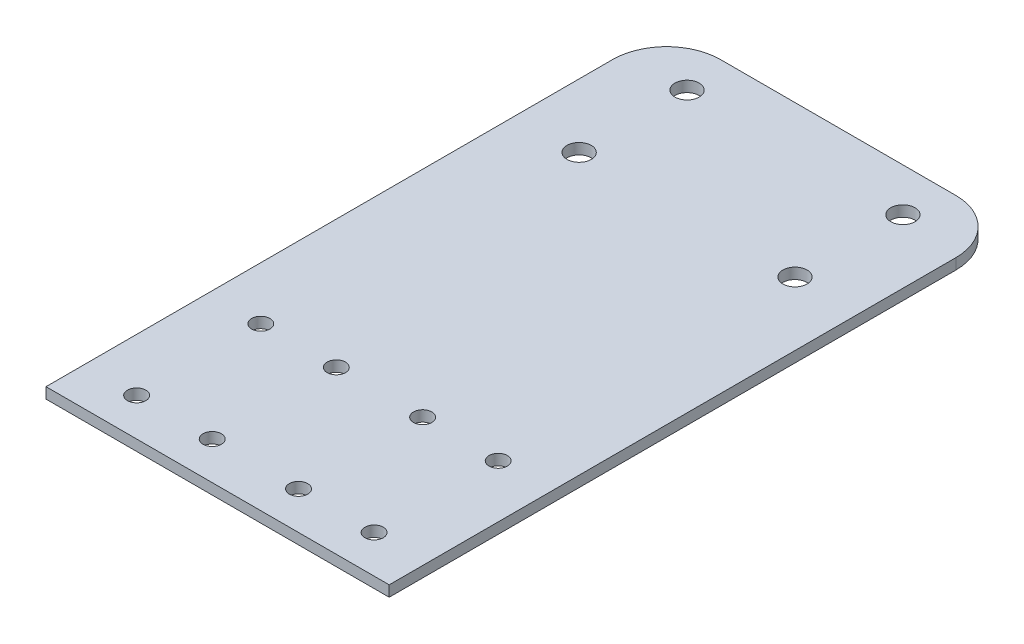
ISO-10303-21;
HEADER;
FILE_DESCRIPTION(('STEP AP214'),'2;1');
FILE_NAME('part.step','',(''),(''),'','','');
FILE_SCHEMA(('AUTOMOTIVE_DESIGN { 1 0 10303 214 1 1 1 1 }'));
ENDSEC;
DATA;
#1=APPLICATION_CONTEXT('core data for automotive mechanical design processes');
#2=APPLICATION_PROTOCOL_DEFINITION('international standard','automotive_design',2000,#1);
#3=PRODUCT_CONTEXT('',#1,'mechanical');
#4=PRODUCT('Part','Part','',(#3));
#5=PRODUCT_RELATED_PRODUCT_CATEGORY('part','',(#4));
#6=PRODUCT_DEFINITION_FORMATION('','',#4);
#7=PRODUCT_DEFINITION_CONTEXT('part definition',#1,'design');
#8=PRODUCT_DEFINITION('design','',#6,#7);
#9=PRODUCT_DEFINITION_SHAPE('','',#8);
#10=(LENGTH_UNIT() NAMED_UNIT(*) SI_UNIT(.MILLI.,.METRE.));
#11=(NAMED_UNIT(*) PLANE_ANGLE_UNIT() SI_UNIT($,.RADIAN.));
#12=(NAMED_UNIT(*) SI_UNIT($,.STERADIAN.) SOLID_ANGLE_UNIT());
#13=UNCERTAINTY_MEASURE_WITH_UNIT(LENGTH_MEASURE(1.E-05),#10,'distance_accuracy_value','');
#14=(GEOMETRIC_REPRESENTATION_CONTEXT(3) GLOBAL_UNCERTAINTY_ASSIGNED_CONTEXT((#13)) GLOBAL_UNIT_ASSIGNED_CONTEXT((#10,
#11,#12)) REPRESENTATION_CONTEXT('',''));
#15=CARTESIAN_POINT('',(0.,0.,0.));
#16=DIRECTION('',(0.,0.,1.));
#17=DIRECTION('',(1.,0.,0.));
#18=AXIS2_PLACEMENT_3D('',#15,#16,#17);
#19=CARTESIAN_POINT('',(31.8,0.,0.));
#20=DIRECTION('',(0.,0.,1.));
#21=DIRECTION('',(1.,0.,0.));
#22=AXIS2_PLACEMENT_3D('',#19,#20,#21);
#23=PLANE('',#22);
#24=DIRECTION('',(-1.,0.,0.));
#25=VECTOR('',#24,1.);
#26=CARTESIAN_POINT('',(31.8,0.,0.));
#27=LINE('',#26,#25);
#28=CARTESIAN_POINT('',(21.8,0.,0.));
#29=VERTEX_POINT('',#28);
#30=CARTESIAN_POINT('',(-21.8,0.,0.));
#31=VERTEX_POINT('',#30);
#32=EDGE_CURVE('E123',#29,#31,#27,.T.);
#33=ORIENTED_EDGE('',*,*,#32,.T.);
#34=DIRECTION('',(0.,1.,0.));
#35=VECTOR('',#34,1.);
#36=CARTESIAN_POINT('',(-21.8,0.,0.));
#37=LINE('',#36,#35);
#38=CARTESIAN_POINT('',(-21.8,2.,0.));
#39=VERTEX_POINT('',#38);
#40=EDGE_CURVE('E133',#31,#39,#37,.T.);
#41=ORIENTED_EDGE('',*,*,#40,.T.);
#42=DIRECTION('',(-1.,0.,0.));
#43=VECTOR('',#42,1.);
#44=CARTESIAN_POINT('',(31.8,2.,0.));
#45=LINE('',#44,#43);
#46=CARTESIAN_POINT('',(21.8,2.,0.));
#47=VERTEX_POINT('',#46);
#48=EDGE_CURVE('E107',#47,#39,#45,.T.);
#49=ORIENTED_EDGE('',*,*,#48,.F.);
#50=DIRECTION('',(0.,1.,0.));
#51=VECTOR('',#50,1.);
#52=CARTESIAN_POINT('',(21.8,0.,0.));
#53=LINE('',#52,#51);
#54=EDGE_CURVE('E126',#47,#29,#53,.F.);
#55=ORIENTED_EDGE('',*,*,#54,.T.);
#56=EDGE_LOOP('',(#33,#41,#49,#55));
#57=FACE_BOUND('',#56,.T.);
#58=ADVANCED_FACE('F34',(#57),#23,.F.);
#59=CARTESIAN_POINT('',(31.8,1.99999999999999,55.));
#60=DIRECTION('',(0.,-1.,0.));
#61=DIRECTION('',(0.,0.,-1.));
#62=AXIS2_PLACEMENT_3D('',#59,#60,#61);
#63=PLANE('',#62);
#64=CARTESIAN_POINT('',(-20.,2.,28.));
#65=DIRECTION('',(0.,1.,0.));
#66=DIRECTION('',(0.,0.,1.));
#67=AXIS2_PLACEMENT_3D('',#64,#65,#66);
#68=CIRCLE('',#67,2.25);
#69=CARTESIAN_POINT('',(-20.,2.,30.25));
#70=VERTEX_POINT('',#69);
#71=EDGE_CURVE('E214',#70,#70,#68,.T.);
#72=ORIENTED_EDGE('',*,*,#71,.F.);
#73=EDGE_LOOP('',(#72));
#74=FACE_BOUND('',#73,.T.);
#75=CARTESIAN_POINT('',(20.,2.,28.));
#76=DIRECTION('',(0.,1.,0.));
#77=DIRECTION('',(0.,0.,1.));
#78=AXIS2_PLACEMENT_3D('',#75,#76,#77);
#79=CIRCLE('',#78,2.25);
#80=CARTESIAN_POINT('',(20.,2.,30.25));
#81=VERTEX_POINT('',#80);
#82=EDGE_CURVE('E131',#81,#81,#79,.T.);
#83=ORIENTED_EDGE('',*,*,#82,.F.);
#84=EDGE_LOOP('',(#83));
#85=FACE_BOUND('',#84,.T.);
#86=CARTESIAN_POINT('',(20.,2.,8.));
#87=DIRECTION('',(0.,1.,0.));
#88=DIRECTION('',(0.,0.,1.));
#89=AXIS2_PLACEMENT_3D('',#86,#87,#88);
#90=CIRCLE('',#89,2.25);
#91=CARTESIAN_POINT('',(20.,2.,10.25));
#92=VERTEX_POINT('',#91);
#93=EDGE_CURVE('E130',#92,#92,#90,.T.);
#94=ORIENTED_EDGE('',*,*,#93,.F.);
#95=EDGE_LOOP('',(#94));
#96=FACE_BOUND('',#95,.T.);
#97=CARTESIAN_POINT('',(-20.,2.,8.));
#98=DIRECTION('',(0.,1.,0.));
#99=DIRECTION('',(0.,0.,1.));
#100=AXIS2_PLACEMENT_3D('',#97,#98,#99);
#101=CIRCLE('',#100,2.25);
#102=CARTESIAN_POINT('',(-20.,2.,10.25));
#103=VERTEX_POINT('',#102);
#104=EDGE_CURVE('E201',#103,#103,#101,.T.);
#105=ORIENTED_EDGE('',*,*,#104,.F.);
#106=EDGE_LOOP('',(#105));
#107=FACE_BOUND('',#106,.T.);
#108=CARTESIAN_POINT('',(-22.,1.99999999999999,108.));
#109=DIRECTION('',(0.,1.,0.));
#110=DIRECTION('',(0.,0.,1.));
#111=AXIS2_PLACEMENT_3D('',#108,#109,#110);
#112=CIRCLE('',#111,1.69999999999999);
#113=CARTESIAN_POINT('',(-22.,1.99999999999999,109.7));
#114=VERTEX_POINT('',#113);
#115=EDGE_CURVE('E195',#114,#114,#112,.T.);
#116=ORIENTED_EDGE('',*,*,#115,.F.);
#117=EDGE_LOOP('',(#116));
#118=FACE_BOUND('',#117,.T.);
#119=CARTESIAN_POINT('',(-22.,1.99999999999999,85.));
#120=DIRECTION('',(0.,1.,0.));
#121=DIRECTION('',(0.,0.,1.));
#122=AXIS2_PLACEMENT_3D('',#119,#120,#121);
#123=CIRCLE('',#122,1.69999999999999);
#124=CARTESIAN_POINT('',(-22.,1.99999999999999,86.7));
#125=VERTEX_POINT('',#124);
#126=EDGE_CURVE('E189',#125,#125,#123,.T.);
#127=ORIENTED_EDGE('',*,*,#126,.F.);
#128=EDGE_LOOP('',(#127));
#129=FACE_BOUND('',#128,.T.);
#130=CARTESIAN_POINT('',(-8.,1.99999999999999,85.));
#131=DIRECTION('',(0.,1.,0.));
#132=DIRECTION('',(0.,0.,1.));
#133=AXIS2_PLACEMENT_3D('',#130,#131,#132);
#134=CIRCLE('',#133,1.69999999999999);
#135=CARTESIAN_POINT('',(-8.,1.99999999999999,86.7));
#136=VERTEX_POINT('',#135);
#137=EDGE_CURVE('E183',#136,#136,#134,.T.);
#138=ORIENTED_EDGE('',*,*,#137,.F.);
#139=EDGE_LOOP('',(#138));
#140=FACE_BOUND('',#139,.T.);
#141=CARTESIAN_POINT('',(-8.,1.99999999999999,108.));
#142=DIRECTION('',(0.,1.,0.));
#143=DIRECTION('',(0.,0.,1.));
#144=AXIS2_PLACEMENT_3D('',#141,#142,#143);
#145=CIRCLE('',#144,1.69999999999999);
#146=CARTESIAN_POINT('',(-8.,1.99999999999999,109.7));
#147=VERTEX_POINT('',#146);
#148=EDGE_CURVE('E177',#147,#147,#145,.T.);
#149=ORIENTED_EDGE('',*,*,#148,.F.);
#150=EDGE_LOOP('',(#149));
#151=FACE_BOUND('',#150,.T.);
#152=CARTESIAN_POINT('',(22.,1.99999999999999,108.));
#153=DIRECTION('',(0.,1.,0.));
#154=DIRECTION('',(0.,0.,1.));
#155=AXIS2_PLACEMENT_3D('',#152,#153,#154);
#156=CIRCLE('',#155,1.69999999999999);
#157=CARTESIAN_POINT('',(22.,1.99999999999999,109.7));
#158=VERTEX_POINT('',#157);
#159=EDGE_CURVE('E171',#158,#158,#156,.T.);
#160=ORIENTED_EDGE('',*,*,#159,.F.);
#161=EDGE_LOOP('',(#160));
#162=FACE_BOUND('',#161,.T.);
#163=CARTESIAN_POINT('',(8.,1.99999999999999,108.));
#164=DIRECTION('',(0.,1.,0.));
#165=DIRECTION('',(0.,0.,1.));
#166=AXIS2_PLACEMENT_3D('',#163,#164,#165);
#167=CIRCLE('',#166,1.69999999999999);
#168=CARTESIAN_POINT('',(8.,1.99999999999999,109.7));
#169=VERTEX_POINT('',#168);
#170=EDGE_CURVE('E165',#169,#169,#167,.T.);
#171=ORIENTED_EDGE('',*,*,#170,.F.);
#172=EDGE_LOOP('',(#171));
#173=FACE_BOUND('',#172,.T.);
#174=CARTESIAN_POINT('',(8.,1.99999999999999,85.));
#175=DIRECTION('',(0.,1.,0.));
#176=DIRECTION('',(0.,0.,1.));
#177=AXIS2_PLACEMENT_3D('',#174,#175,#176);
#178=CIRCLE('',#177,1.69999999999999);
#179=CARTESIAN_POINT('',(8.,1.99999999999999,86.7));
#180=VERTEX_POINT('',#179);
#181=EDGE_CURVE('E159',#180,#180,#178,.T.);
#182=ORIENTED_EDGE('',*,*,#181,.F.);
#183=EDGE_LOOP('',(#182));
#184=FACE_BOUND('',#183,.T.);
#185=CARTESIAN_POINT('',(22.,1.99999999999999,85.));
#186=DIRECTION('',(0.,1.,0.));
#187=DIRECTION('',(0.,0.,1.));
#188=AXIS2_PLACEMENT_3D('',#185,#186,#187);
#189=CIRCLE('',#188,1.69999999999999);
#190=CARTESIAN_POINT('',(22.,1.99999999999999,86.7));
#191=VERTEX_POINT('',#190);
#192=EDGE_CURVE('E153',#191,#191,#189,.T.);
#193=ORIENTED_EDGE('',*,*,#192,.F.);
#194=EDGE_LOOP('',(#193));
#195=FACE_BOUND('',#194,.T.);
#196=ORIENTED_EDGE('',*,*,#48,.T.);
#197=CARTESIAN_POINT('',(-21.8,2.,10.));
#198=DIRECTION('',(0.,-1.,0.));
#199=DIRECTION('',(0.,0.,-1.));
#200=AXIS2_PLACEMENT_3D('',#197,#198,#199);
#201=CIRCLE('',#200,10.);
#202=CARTESIAN_POINT('',(-31.8,2.,10.));
#203=VERTEX_POINT('',#202);
#204=EDGE_CURVE('E138',#39,#203,#201,.F.);
#205=ORIENTED_EDGE('',*,*,#204,.T.);
#206=DIRECTION('',(0.,0.,1.));
#207=VECTOR('',#206,1.);
#208=CARTESIAN_POINT('',(-31.8,1.99999999999999,55.));
#209=LINE('',#208,#207);
#210=CARTESIAN_POINT('',(-31.8,1.99999999999999,115.));
#211=VERTEX_POINT('',#210);
#212=EDGE_CURVE('E103',#203,#211,#209,.T.);
#213=ORIENTED_EDGE('',*,*,#212,.T.);
#214=DIRECTION('',(-1.,0.,0.));
#215=VECTOR('',#214,1.);
#216=CARTESIAN_POINT('',(31.8,1.99999999999999,115.));
#217=LINE('',#216,#215);
#218=CARTESIAN_POINT('',(31.8,1.99999999999999,115.));
#219=VERTEX_POINT('',#218);
#220=EDGE_CURVE('E100',#219,#211,#217,.T.);
#221=ORIENTED_EDGE('',*,*,#220,.F.);
#222=DIRECTION('',(0.,0.,1.));
#223=VECTOR('',#222,1.);
#224=CARTESIAN_POINT('',(31.8,2.,0.));
#225=LINE('',#224,#223);
#226=CARTESIAN_POINT('',(31.8,2.,10.));
#227=VERTEX_POINT('',#226);
#228=EDGE_CURVE('E89',#227,#219,#225,.T.);
#229=ORIENTED_EDGE('',*,*,#228,.F.);
#230=CARTESIAN_POINT('',(21.8,2.,10.));
#231=DIRECTION('',(0.,-1.,0.));
#232=DIRECTION('',(0.,0.,-1.));
#233=AXIS2_PLACEMENT_3D('',#230,#231,#232);
#234=CIRCLE('',#233,10.);
#235=EDGE_CURVE('E136',#227,#47,#234,.F.);
#236=ORIENTED_EDGE('',*,*,#235,.T.);
#237=EDGE_LOOP('',(#196,#205,#213,#221,#229,#236));
#238=FACE_BOUND('',#237,.T.);
#239=ADVANCED_FACE('F102',(#74,#85,#96,#107,#118,#129,#140,#151,#162,#173,#184,#195,#238),#63,.F.);
#240=CARTESIAN_POINT('',(31.8,1.99999999999999,115.));
#241=DIRECTION('',(0.,0.,-1.));
#242=DIRECTION('',(-1.,0.,0.));
#243=AXIS2_PLACEMENT_3D('',#240,#241,#242);
#244=PLANE('',#243);
#245=DIRECTION('',(0.,-1.,0.));
#246=VECTOR('',#245,1.);
#247=CARTESIAN_POINT('',(-31.8,1.99999999999999,115.));
#248=LINE('',#247,#246);
#249=CARTESIAN_POINT('',(-31.8,0.,115.));
#250=VERTEX_POINT('',#249);
#251=EDGE_CURVE('E117',#211,#250,#248,.T.);
#252=ORIENTED_EDGE('',*,*,#251,.T.);
#253=DIRECTION('',(-1.,0.,0.));
#254=VECTOR('',#253,1.);
#255=CARTESIAN_POINT('',(31.8,0.,115.));
#256=LINE('',#255,#254);
#257=CARTESIAN_POINT('',(31.8,0.,115.));
#258=VERTEX_POINT('',#257);
#259=EDGE_CURVE('E108',#258,#250,#256,.T.);
#260=ORIENTED_EDGE('',*,*,#259,.F.);
#261=DIRECTION('',(0.,-1.,0.));
#262=VECTOR('',#261,1.);
#263=CARTESIAN_POINT('',(31.8,1.99999999999999,115.));
#264=LINE('',#263,#262);
#265=EDGE_CURVE('E93',#219,#258,#264,.T.);
#266=ORIENTED_EDGE('',*,*,#265,.F.);
#267=ORIENTED_EDGE('',*,*,#220,.T.);
#268=EDGE_LOOP('',(#252,#260,#266,#267));
#269=FACE_BOUND('',#268,.T.);
#270=ADVANCED_FACE('F110',(#269),#244,.F.);
#271=CARTESIAN_POINT('',(31.8,0.,35.));
#272=DIRECTION('',(0.,1.,0.));
#273=DIRECTION('',(0.,0.,1.));
#274=AXIS2_PLACEMENT_3D('',#271,#272,#273);
#275=PLANE('',#274);
#276=CARTESIAN_POINT('',(-20.,0.,28.));
#277=DIRECTION('',(0.,1.,0.));
#278=DIRECTION('',(0.,0.,1.));
#279=AXIS2_PLACEMENT_3D('',#276,#277,#278);
#280=CIRCLE('',#279,2.25);
#281=CARTESIAN_POINT('',(-20.,0.,30.25));
#282=VERTEX_POINT('',#281);
#283=EDGE_CURVE('E211',#282,#282,#280,.T.);
#284=ORIENTED_EDGE('',*,*,#283,.T.);
#285=EDGE_LOOP('',(#284));
#286=FACE_BOUND('',#285,.T.);
#287=CARTESIAN_POINT('',(20.,0.,28.));
#288=DIRECTION('',(0.,1.,0.));
#289=DIRECTION('',(0.,0.,1.));
#290=AXIS2_PLACEMENT_3D('',#287,#288,#289);
#291=CIRCLE('',#290,2.25);
#292=CARTESIAN_POINT('',(20.,0.,30.25));
#293=VERTEX_POINT('',#292);
#294=EDGE_CURVE('E127',#293,#293,#291,.T.);
#295=ORIENTED_EDGE('',*,*,#294,.T.);
#296=EDGE_LOOP('',(#295));
#297=FACE_BOUND('',#296,.T.);
#298=CARTESIAN_POINT('',(20.,0.,8.));
#299=DIRECTION('',(0.,1.,0.));
#300=DIRECTION('',(0.,0.,1.));
#301=AXIS2_PLACEMENT_3D('',#298,#299,#300);
#302=CIRCLE('',#301,2.25);
#303=CARTESIAN_POINT('',(20.,0.,10.25));
#304=VERTEX_POINT('',#303);
#305=EDGE_CURVE('E204',#304,#304,#302,.T.);
#306=ORIENTED_EDGE('',*,*,#305,.T.);
#307=EDGE_LOOP('',(#306));
#308=FACE_BOUND('',#307,.T.);
#309=CARTESIAN_POINT('',(-20.,0.,8.));
#310=DIRECTION('',(0.,1.,0.));
#311=DIRECTION('',(0.,0.,1.));
#312=AXIS2_PLACEMENT_3D('',#309,#310,#311);
#313=CIRCLE('',#312,2.25);
#314=CARTESIAN_POINT('',(-20.,0.,10.25));
#315=VERTEX_POINT('',#314);
#316=EDGE_CURVE('E198',#315,#315,#313,.T.);
#317=ORIENTED_EDGE('',*,*,#316,.T.);
#318=EDGE_LOOP('',(#317));
#319=FACE_BOUND('',#318,.T.);
#320=CARTESIAN_POINT('',(-22.,0.,108.));
#321=DIRECTION('',(0.,1.,0.));
#322=DIRECTION('',(0.,0.,1.));
#323=AXIS2_PLACEMENT_3D('',#320,#321,#322);
#324=CIRCLE('',#323,1.69999999999999);
#325=CARTESIAN_POINT('',(-22.,0.,109.7));
#326=VERTEX_POINT('',#325);
#327=EDGE_CURVE('E192',#326,#326,#324,.T.);
#328=ORIENTED_EDGE('',*,*,#327,.T.);
#329=EDGE_LOOP('',(#328));
#330=FACE_BOUND('',#329,.T.);
#331=CARTESIAN_POINT('',(-22.,0.,85.));
#332=DIRECTION('',(0.,1.,0.));
#333=DIRECTION('',(0.,0.,1.));
#334=AXIS2_PLACEMENT_3D('',#331,#332,#333);
#335=CIRCLE('',#334,1.69999999999999);
#336=CARTESIAN_POINT('',(-22.,0.,86.7));
#337=VERTEX_POINT('',#336);
#338=EDGE_CURVE('E186',#337,#337,#335,.T.);
#339=ORIENTED_EDGE('',*,*,#338,.T.);
#340=EDGE_LOOP('',(#339));
#341=FACE_BOUND('',#340,.T.);
#342=CARTESIAN_POINT('',(-8.,0.,85.));
#343=DIRECTION('',(0.,1.,0.));
#344=DIRECTION('',(0.,0.,1.));
#345=AXIS2_PLACEMENT_3D('',#342,#343,#344);
#346=CIRCLE('',#345,1.69999999999999);
#347=CARTESIAN_POINT('',(-8.,0.,86.7));
#348=VERTEX_POINT('',#347);
#349=EDGE_CURVE('E180',#348,#348,#346,.T.);
#350=ORIENTED_EDGE('',*,*,#349,.T.);
#351=EDGE_LOOP('',(#350));
#352=FACE_BOUND('',#351,.T.);
#353=CARTESIAN_POINT('',(-8.,0.,108.));
#354=DIRECTION('',(0.,1.,0.));
#355=DIRECTION('',(0.,0.,1.));
#356=AXIS2_PLACEMENT_3D('',#353,#354,#355);
#357=CIRCLE('',#356,1.69999999999999);
#358=CARTESIAN_POINT('',(-8.,0.,109.7));
#359=VERTEX_POINT('',#358);
#360=EDGE_CURVE('E174',#359,#359,#357,.T.);
#361=ORIENTED_EDGE('',*,*,#360,.T.);
#362=EDGE_LOOP('',(#361));
#363=FACE_BOUND('',#362,.T.);
#364=CARTESIAN_POINT('',(22.,0.,108.));
#365=DIRECTION('',(0.,1.,0.));
#366=DIRECTION('',(0.,0.,1.));
#367=AXIS2_PLACEMENT_3D('',#364,#365,#366);
#368=CIRCLE('',#367,1.69999999999999);
#369=CARTESIAN_POINT('',(22.,0.,109.7));
#370=VERTEX_POINT('',#369);
#371=EDGE_CURVE('E168',#370,#370,#368,.T.);
#372=ORIENTED_EDGE('',*,*,#371,.T.);
#373=EDGE_LOOP('',(#372));
#374=FACE_BOUND('',#373,.T.);
#375=CARTESIAN_POINT('',(8.,0.,108.));
#376=DIRECTION('',(0.,1.,0.));
#377=DIRECTION('',(0.,0.,1.));
#378=AXIS2_PLACEMENT_3D('',#375,#376,#377);
#379=CIRCLE('',#378,1.69999999999999);
#380=CARTESIAN_POINT('',(8.,0.,109.7));
#381=VERTEX_POINT('',#380);
#382=EDGE_CURVE('E162',#381,#381,#379,.T.);
#383=ORIENTED_EDGE('',*,*,#382,.T.);
#384=EDGE_LOOP('',(#383));
#385=FACE_BOUND('',#384,.T.);
#386=CARTESIAN_POINT('',(8.,0.,85.));
#387=DIRECTION('',(0.,1.,0.));
#388=DIRECTION('',(0.,0.,1.));
#389=AXIS2_PLACEMENT_3D('',#386,#387,#388);
#390=CIRCLE('',#389,1.69999999999999);
#391=CARTESIAN_POINT('',(8.,0.,86.7));
#392=VERTEX_POINT('',#391);
#393=EDGE_CURVE('E156',#392,#392,#390,.T.);
#394=ORIENTED_EDGE('',*,*,#393,.T.);
#395=EDGE_LOOP('',(#394));
#396=FACE_BOUND('',#395,.T.);
#397=CARTESIAN_POINT('',(22.,0.,85.));
#398=DIRECTION('',(0.,1.,0.));
#399=DIRECTION('',(0.,0.,1.));
#400=AXIS2_PLACEMENT_3D('',#397,#398,#399);
#401=CIRCLE('',#400,1.69999999999999);
#402=CARTESIAN_POINT('',(22.,0.,86.7));
#403=VERTEX_POINT('',#402);
#404=EDGE_CURVE('E118',#403,#403,#401,.T.);
#405=ORIENTED_EDGE('',*,*,#404,.T.);
#406=EDGE_LOOP('',(#405));
#407=FACE_BOUND('',#406,.T.);
#408=DIRECTION('',(0.,0.,-1.));
#409=VECTOR('',#408,1.);
#410=CARTESIAN_POINT('',(-31.8,0.,35.));
#411=LINE('',#410,#409);
#412=CARTESIAN_POINT('',(-31.8,0.,10.));
#413=VERTEX_POINT('',#412);
#414=EDGE_CURVE('E120',#250,#413,#411,.T.);
#415=ORIENTED_EDGE('',*,*,#414,.T.);
#416=CARTESIAN_POINT('',(-21.8,0.,10.));
#417=DIRECTION('',(0.,1.,0.));
#418=DIRECTION('',(0.,0.,1.));
#419=AXIS2_PLACEMENT_3D('',#416,#417,#418);
#420=CIRCLE('',#419,10.);
#421=EDGE_CURVE('E42',#413,#31,#420,.F.);
#422=ORIENTED_EDGE('',*,*,#421,.T.);
#423=ORIENTED_EDGE('',*,*,#32,.F.);
#424=CARTESIAN_POINT('',(21.8,0.,10.));
#425=DIRECTION('',(0.,1.,0.));
#426=DIRECTION('',(0.,0.,1.));
#427=AXIS2_PLACEMENT_3D('',#424,#425,#426);
#428=CIRCLE('',#427,10.);
#429=CARTESIAN_POINT('',(31.8,0.,10.));
#430=VERTEX_POINT('',#429);
#431=EDGE_CURVE('E49',#29,#430,#428,.F.);
#432=ORIENTED_EDGE('',*,*,#431,.T.);
#433=DIRECTION('',(0.,0.,-1.));
#434=VECTOR('',#433,1.);
#435=CARTESIAN_POINT('',(31.8,0.,0.));
#436=LINE('',#435,#434);
#437=EDGE_CURVE('E97',#258,#430,#436,.T.);
#438=ORIENTED_EDGE('',*,*,#437,.F.);
#439=ORIENTED_EDGE('',*,*,#259,.T.);
#440=EDGE_LOOP('',(#415,#422,#423,#432,#438,#439));
#441=FACE_BOUND('',#440,.T.);
#442=ADVANCED_FACE('F142',(#286,#297,#308,#319,#330,#341,#352,#363,#374,#385,#396,#407,#441),
#275,.F.);
#443=CARTESIAN_POINT('',(31.8,0.,0.));
#444=DIRECTION('',(1.,0.,0.));
#445=DIRECTION('',(0.,0.,-1.));
#446=AXIS2_PLACEMENT_3D('',#443,#444,#445);
#447=PLANE('',#446);
#448=ORIENTED_EDGE('',*,*,#437,.T.);
#449=DIRECTION('',(0.,1.,0.));
#450=VECTOR('',#449,1.);
#451=CARTESIAN_POINT('',(31.8,2.,10.));
#452=LINE('',#451,#450);
#453=EDGE_CURVE('E11',#430,#227,#452,.T.);
#454=ORIENTED_EDGE('',*,*,#453,.T.);
#455=ORIENTED_EDGE('',*,*,#228,.T.);
#456=ORIENTED_EDGE('',*,*,#265,.T.);
#457=EDGE_LOOP('',(#448,#454,#455,#456));
#458=FACE_BOUND('',#457,.T.);
#459=ADVANCED_FACE('F91',(#458),#447,.T.);
#460=CARTESIAN_POINT('',(-31.8,0.,0.));
#461=DIRECTION('',(1.,0.,0.));
#462=DIRECTION('',(0.,0.,-1.));
#463=AXIS2_PLACEMENT_3D('',#460,#461,#462);
#464=PLANE('',#463);
#465=ORIENTED_EDGE('',*,*,#212,.F.);
#466=DIRECTION('',(0.,1.,0.));
#467=VECTOR('',#466,1.);
#468=CARTESIAN_POINT('',(-31.8,0.,10.));
#469=LINE('',#468,#467);
#470=EDGE_CURVE('E57',#203,#413,#469,.F.);
#471=ORIENTED_EDGE('',*,*,#470,.T.);
#472=ORIENTED_EDGE('',*,*,#414,.F.);
#473=ORIENTED_EDGE('',*,*,#251,.F.);
#474=EDGE_LOOP('',(#465,#471,#472,#473));
#475=FACE_BOUND('',#474,.T.);
#476=ADVANCED_FACE('F149',(#475),#464,.F.);
#477=CARTESIAN_POINT('',(22.,1.99999999999999,85.));
#478=DIRECTION('',(0.,1.,0.));
#479=DIRECTION('',(0.,0.,1.));
#480=AXIS2_PLACEMENT_3D('',#477,#478,#479);
#481=CYLINDRICAL_SURFACE('',#480,1.69999999999999);
#482=ORIENTED_EDGE('',*,*,#192,.T.);
#483=EDGE_LOOP('',(#482));
#484=FACE_BOUND('',#483,.T.);
#485=ORIENTED_EDGE('',*,*,#404,.F.);
#486=EDGE_LOOP('',(#485));
#487=FACE_BOUND('',#486,.T.);
#488=ADVANCED_FACE('F246',(#484,#487),#481,.F.);
#489=CARTESIAN_POINT('',(8.,1.99999999999999,85.));
#490=DIRECTION('',(0.,1.,0.));
#491=DIRECTION('',(0.,0.,1.));
#492=AXIS2_PLACEMENT_3D('',#489,#490,#491);
#493=CYLINDRICAL_SURFACE('',#492,1.69999999999999);
#494=ORIENTED_EDGE('',*,*,#181,.T.);
#495=EDGE_LOOP('',(#494));
#496=FACE_BOUND('',#495,.T.);
#497=ORIENTED_EDGE('',*,*,#393,.F.);
#498=EDGE_LOOP('',(#497));
#499=FACE_BOUND('',#498,.T.);
#500=ADVANCED_FACE('F249',(#496,#499),#493,.F.);
#501=CARTESIAN_POINT('',(8.,1.99999999999999,108.));
#502=DIRECTION('',(0.,1.,0.));
#503=DIRECTION('',(0.,0.,1.));
#504=AXIS2_PLACEMENT_3D('',#501,#502,#503);
#505=CYLINDRICAL_SURFACE('',#504,1.69999999999999);
#506=ORIENTED_EDGE('',*,*,#170,.T.);
#507=EDGE_LOOP('',(#506));
#508=FACE_BOUND('',#507,.T.);
#509=ORIENTED_EDGE('',*,*,#382,.F.);
#510=EDGE_LOOP('',(#509));
#511=FACE_BOUND('',#510,.T.);
#512=ADVANCED_FACE('F309',(#508,#511),#505,.F.);
#513=CARTESIAN_POINT('',(22.,1.99999999999999,108.));
#514=DIRECTION('',(0.,1.,0.));
#515=DIRECTION('',(0.,0.,1.));
#516=AXIS2_PLACEMENT_3D('',#513,#514,#515);
#517=CYLINDRICAL_SURFACE('',#516,1.69999999999999);
#518=ORIENTED_EDGE('',*,*,#159,.T.);
#519=EDGE_LOOP('',(#518));
#520=FACE_BOUND('',#519,.T.);
#521=ORIENTED_EDGE('',*,*,#371,.F.);
#522=EDGE_LOOP('',(#521));
#523=FACE_BOUND('',#522,.T.);
#524=ADVANCED_FACE('F305',(#520,#523),#517,.F.);
#525=CARTESIAN_POINT('',(-8.,1.99999999999999,108.));
#526=DIRECTION('',(0.,1.,0.));
#527=DIRECTION('',(0.,0.,1.));
#528=AXIS2_PLACEMENT_3D('',#525,#526,#527);
#529=CYLINDRICAL_SURFACE('',#528,1.69999999999999);
#530=ORIENTED_EDGE('',*,*,#148,.T.);
#531=EDGE_LOOP('',(#530));
#532=FACE_BOUND('',#531,.T.);
#533=ORIENTED_EDGE('',*,*,#360,.F.);
#534=EDGE_LOOP('',(#533));
#535=FACE_BOUND('',#534,.T.);
#536=ADVANCED_FACE('F301',(#532,#535),#529,.F.);
#537=CARTESIAN_POINT('',(-8.,1.99999999999999,85.));
#538=DIRECTION('',(0.,1.,0.));
#539=DIRECTION('',(0.,0.,1.));
#540=AXIS2_PLACEMENT_3D('',#537,#538,#539);
#541=CYLINDRICAL_SURFACE('',#540,1.69999999999999);
#542=ORIENTED_EDGE('',*,*,#137,.T.);
#543=EDGE_LOOP('',(#542));
#544=FACE_BOUND('',#543,.T.);
#545=ORIENTED_EDGE('',*,*,#349,.F.);
#546=EDGE_LOOP('',(#545));
#547=FACE_BOUND('',#546,.T.);
#548=ADVANCED_FACE('F297',(#544,#547),#541,.F.);
#549=CARTESIAN_POINT('',(-22.,1.99999999999999,85.));
#550=DIRECTION('',(0.,1.,0.));
#551=DIRECTION('',(0.,0.,1.));
#552=AXIS2_PLACEMENT_3D('',#549,#550,#551);
#553=CYLINDRICAL_SURFACE('',#552,1.69999999999999);
#554=ORIENTED_EDGE('',*,*,#126,.T.);
#555=EDGE_LOOP('',(#554));
#556=FACE_BOUND('',#555,.T.);
#557=ORIENTED_EDGE('',*,*,#338,.F.);
#558=EDGE_LOOP('',(#557));
#559=FACE_BOUND('',#558,.T.);
#560=ADVANCED_FACE('F293',(#556,#559),#553,.F.);
#561=CARTESIAN_POINT('',(-22.,1.99999999999999,108.));
#562=DIRECTION('',(0.,1.,0.));
#563=DIRECTION('',(0.,0.,1.));
#564=AXIS2_PLACEMENT_3D('',#561,#562,#563);
#565=CYLINDRICAL_SURFACE('',#564,1.69999999999999);
#566=ORIENTED_EDGE('',*,*,#115,.T.);
#567=EDGE_LOOP('',(#566));
#568=FACE_BOUND('',#567,.T.);
#569=ORIENTED_EDGE('',*,*,#327,.F.);
#570=EDGE_LOOP('',(#569));
#571=FACE_BOUND('',#570,.T.);
#572=ADVANCED_FACE('F289',(#568,#571),#565,.F.);
#573=CARTESIAN_POINT('',(-20.,2.,8.));
#574=DIRECTION('',(0.,1.,0.));
#575=DIRECTION('',(0.,0.,1.));
#576=AXIS2_PLACEMENT_3D('',#573,#574,#575);
#577=CYLINDRICAL_SURFACE('',#576,2.25);
#578=ORIENTED_EDGE('',*,*,#104,.T.);
#579=EDGE_LOOP('',(#578));
#580=FACE_BOUND('',#579,.T.);
#581=ORIENTED_EDGE('',*,*,#316,.F.);
#582=EDGE_LOOP('',(#581));
#583=FACE_BOUND('',#582,.T.);
#584=ADVANCED_FACE('F285',(#580,#583),#577,.F.);
#585=CARTESIAN_POINT('',(20.,2.,8.));
#586=DIRECTION('',(0.,1.,0.));
#587=DIRECTION('',(0.,0.,1.));
#588=AXIS2_PLACEMENT_3D('',#585,#586,#587);
#589=CYLINDRICAL_SURFACE('',#588,2.25);
#590=ORIENTED_EDGE('',*,*,#93,.T.);
#591=EDGE_LOOP('',(#590));
#592=FACE_BOUND('',#591,.T.);
#593=ORIENTED_EDGE('',*,*,#305,.F.);
#594=EDGE_LOOP('',(#593));
#595=FACE_BOUND('',#594,.T.);
#596=ADVANCED_FACE('F279',(#592,#595),#589,.F.);
#597=CARTESIAN_POINT('',(20.,2.,28.));
#598=DIRECTION('',(0.,1.,0.));
#599=DIRECTION('',(0.,0.,1.));
#600=AXIS2_PLACEMENT_3D('',#597,#598,#599);
#601=CYLINDRICAL_SURFACE('',#600,2.25);
#602=ORIENTED_EDGE('',*,*,#82,.T.);
#603=EDGE_LOOP('',(#602));
#604=FACE_BOUND('',#603,.T.);
#605=ORIENTED_EDGE('',*,*,#294,.F.);
#606=EDGE_LOOP('',(#605));
#607=FACE_BOUND('',#606,.T.);
#608=ADVANCED_FACE('F274',(#604,#607),#601,.F.);
#609=CARTESIAN_POINT('',(-20.,2.,28.));
#610=DIRECTION('',(0.,1.,0.));
#611=DIRECTION('',(0.,0.,1.));
#612=AXIS2_PLACEMENT_3D('',#609,#610,#611);
#613=CYLINDRICAL_SURFACE('',#612,2.25);
#614=ORIENTED_EDGE('',*,*,#71,.T.);
#615=EDGE_LOOP('',(#614));
#616=FACE_BOUND('',#615,.T.);
#617=ORIENTED_EDGE('',*,*,#283,.F.);
#618=EDGE_LOOP('',(#617));
#619=FACE_BOUND('',#618,.T.);
#620=ADVANCED_FACE('F218',(#616,#619),#613,.F.);
#621=CARTESIAN_POINT('',(-21.8,0.,10.));
#622=DIRECTION('',(0.,1.,0.));
#623=DIRECTION('',(0.,0.,1.));
#624=AXIS2_PLACEMENT_3D('',#621,#622,#623);
#625=CYLINDRICAL_SURFACE('',#624,10.);
#626=ORIENTED_EDGE('',*,*,#421,.F.);
#627=ORIENTED_EDGE('',*,*,#470,.F.);
#628=ORIENTED_EDGE('',*,*,#204,.F.);
#629=ORIENTED_EDGE('',*,*,#40,.F.);
#630=EDGE_LOOP('',(#626,#627,#628,#629));
#631=FACE_BOUND('',#630,.T.);
#632=ADVANCED_FACE('F148',(#631),#625,.T.);
#633=CARTESIAN_POINT('',(21.8,0.,10.));
#634=DIRECTION('',(0.,-1.,0.));
#635=DIRECTION('',(0.,0.,-1.));
#636=AXIS2_PLACEMENT_3D('',#633,#634,#635);
#637=CYLINDRICAL_SURFACE('',#636,10.);
#638=ORIENTED_EDGE('',*,*,#431,.F.);
#639=ORIENTED_EDGE('',*,*,#54,.F.);
#640=ORIENTED_EDGE('',*,*,#235,.F.);
#641=ORIENTED_EDGE('',*,*,#453,.F.);
#642=EDGE_LOOP('',(#638,#639,#640,#641));
#643=FACE_BOUND('',#642,.T.);
#644=ADVANCED_FACE('F36',(#643),#637,.T.);
#645=CLOSED_SHELL('',(#58,#239,#270,#442,#459,#476,#488,#500,#512,#524,#536,#548,#560,#572,#584,
#596,#608,#620,#632,#644));
#646=MANIFOLD_SOLID_BREP('B2',#645);
#647=ADVANCED_BREP_SHAPE_REPRESENTATION('',(#18,#646),#14);
#648=SHAPE_DEFINITION_REPRESENTATION(#9,#647);
ENDSEC;
END-ISO-10303-21;
